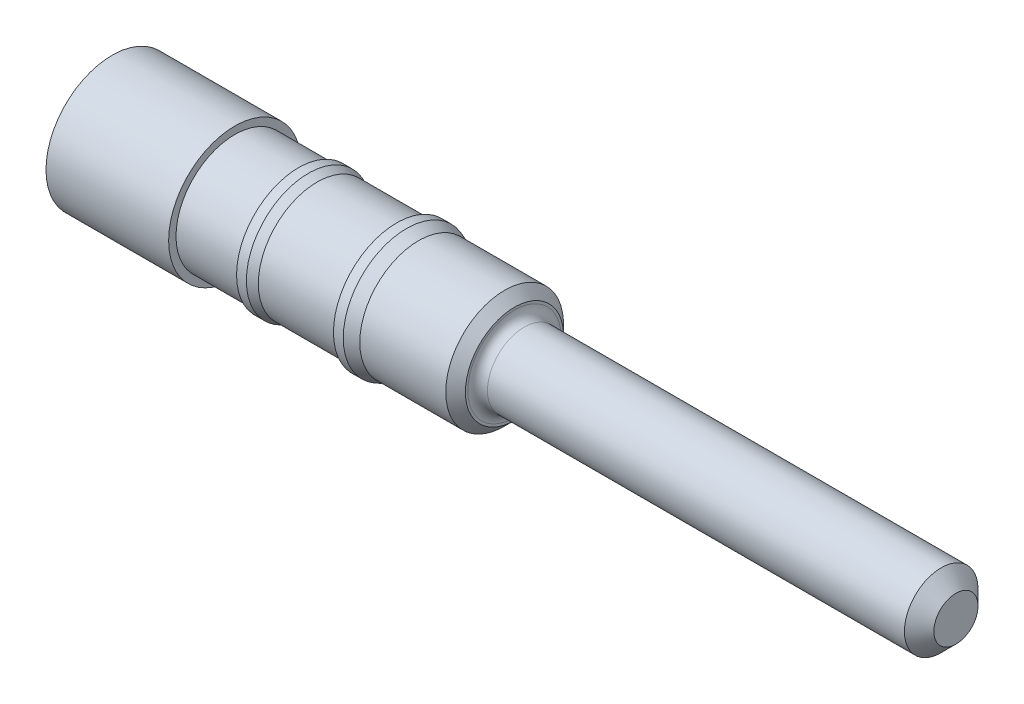
ISO-10303-21;
HEADER;
FILE_DESCRIPTION(('STEP AP214'),'2;1');
FILE_NAME('part.step','',(''),(''),'','','');
FILE_SCHEMA(('AUTOMOTIVE_DESIGN { 1 0 10303 214 1 1 1 1 }'));
ENDSEC;
DATA;
#1=APPLICATION_CONTEXT('core data for automotive mechanical design processes');
#2=APPLICATION_PROTOCOL_DEFINITION('international standard','automotive_design',2000,#1);
#3=PRODUCT_CONTEXT('',#1,'mechanical');
#4=PRODUCT('Part','Part','',(#3));
#5=PRODUCT_RELATED_PRODUCT_CATEGORY('part','',(#4));
#6=PRODUCT_DEFINITION_FORMATION('','',#4);
#7=PRODUCT_DEFINITION_CONTEXT('part definition',#1,'design');
#8=PRODUCT_DEFINITION('design','',#6,#7);
#9=PRODUCT_DEFINITION_SHAPE('','',#8);
#10=(LENGTH_UNIT() NAMED_UNIT(*) SI_UNIT(.MILLI.,.METRE.));
#11=(NAMED_UNIT(*) PLANE_ANGLE_UNIT() SI_UNIT($,.RADIAN.));
#12=(NAMED_UNIT(*) SI_UNIT($,.STERADIAN.) SOLID_ANGLE_UNIT());
#13=UNCERTAINTY_MEASURE_WITH_UNIT(LENGTH_MEASURE(1.E-05),#10,'distance_accuracy_value','');
#14=(GEOMETRIC_REPRESENTATION_CONTEXT(3) GLOBAL_UNCERTAINTY_ASSIGNED_CONTEXT((#13)) GLOBAL_UNIT_ASSIGNED_CONTEXT((#10,
#11,#12)) REPRESENTATION_CONTEXT('',''));
#15=CARTESIAN_POINT('',(0.,0.,0.));
#16=DIRECTION('',(0.,0.,1.));
#17=DIRECTION('',(1.,0.,0.));
#18=AXIS2_PLACEMENT_3D('',#15,#16,#17);
#19=CARTESIAN_POINT('',(0.,0.,0.));
#20=DIRECTION('',(1.,0.,0.));
#21=DIRECTION('',(0.,0.,-1.));
#22=AXIS2_PLACEMENT_3D('',#19,#20,#21);
#23=PLANE('',#22);
#24=CARTESIAN_POINT('',(0.,0.,0.));
#25=DIRECTION('',(-1.,0.,0.));
#26=DIRECTION('',(0.,0.,1.));
#27=AXIS2_PLACEMENT_3D('',#24,#25,#26);
#28=CIRCLE('',#27,0.3048);
#29=CARTESIAN_POINT('',(0.,0.,0.3048));
#30=VERTEX_POINT('',#29);
#31=EDGE_CURVE('E42',#30,#30,#28,.T.);
#32=ORIENTED_EDGE('',*,*,#31,.F.);
#33=EDGE_LOOP('',(#32));
#34=FACE_BOUND('',#33,.T.);
#35=CARTESIAN_POINT('',(0.,0.,0.));
#36=DIRECTION('',(-1.,0.,0.));
#37=DIRECTION('',(0.,0.,1.));
#38=AXIS2_PLACEMENT_3D('',#35,#36,#37);
#39=CIRCLE('',#38,0.3429);
#40=CARTESIAN_POINT('',(0.,0.,0.3429));
#41=VERTEX_POINT('',#40);
#42=EDGE_CURVE('E11',#41,#41,#39,.T.);
#43=ORIENTED_EDGE('',*,*,#42,.T.);
#44=EDGE_LOOP('',(#43));
#45=FACE_BOUND('',#44,.T.);
#46=ADVANCED_FACE('F16',(#34,#45),#23,.F.);
#47=CARTESIAN_POINT('',(0.,0.,0.));
#48=DIRECTION('',(-1.,0.,0.));
#49=DIRECTION('',(0.,0.,1.));
#50=AXIS2_PLACEMENT_3D('',#47,#48,#49);
#51=CYLINDRICAL_SURFACE('',#50,0.3429);
#52=ORIENTED_EDGE('',*,*,#42,.F.);
#53=EDGE_LOOP('',(#52));
#54=FACE_BOUND('',#53,.T.);
#55=CARTESIAN_POINT('',(0.635,0.,0.));
#56=DIRECTION('',(-1.,0.,0.));
#57=DIRECTION('',(0.,0.,1.));
#58=AXIS2_PLACEMENT_3D('',#55,#56,#57);
#59=CIRCLE('',#58,0.3429);
#60=CARTESIAN_POINT('',(0.635,0.,0.3429));
#61=VERTEX_POINT('',#60);
#62=EDGE_CURVE('E22',#61,#61,#59,.T.);
#63=ORIENTED_EDGE('',*,*,#62,.T.);
#64=EDGE_LOOP('',(#63));
#65=FACE_BOUND('',#64,.T.);
#66=ADVANCED_FACE('F89',(#54,#65),#51,.T.);
#67=CARTESIAN_POINT('',(0.635,0.3429,0.));
#68=DIRECTION('',(-1.,0.,0.));
#69=DIRECTION('',(0.,0.,1.));
#70=AXIS2_PLACEMENT_3D('',#67,#68,#69);
#71=PLANE('',#70);
#72=ORIENTED_EDGE('',*,*,#62,.F.);
#73=EDGE_LOOP('',(#72));
#74=FACE_BOUND('',#73,.T.);
#75=CARTESIAN_POINT('',(0.635,0.,0.));
#76=DIRECTION('',(-1.,0.,0.));
#77=DIRECTION('',(0.,0.,1.));
#78=AXIS2_PLACEMENT_3D('',#75,#76,#77);
#79=CIRCLE('',#78,0.3048);
#80=CARTESIAN_POINT('',(0.635,0.,0.3048));
#81=VERTEX_POINT('',#80);
#82=EDGE_CURVE('E84',#81,#81,#79,.T.);
#83=ORIENTED_EDGE('',*,*,#82,.T.);
#84=EDGE_LOOP('',(#83));
#85=FACE_BOUND('',#84,.T.);
#86=ADVANCED_FACE('F91',(#74,#85),#71,.F.);
#87=CARTESIAN_POINT('',(0.,0.,0.));
#88=DIRECTION('',(-1.,0.,0.));
#89=DIRECTION('',(0.,0.,1.));
#90=AXIS2_PLACEMENT_3D('',#87,#88,#89);
#91=CYLINDRICAL_SURFACE('',#90,0.3048);
#92=ORIENTED_EDGE('',*,*,#82,.F.);
#93=EDGE_LOOP('',(#92));
#94=FACE_BOUND('',#93,.T.);
#95=CARTESIAN_POINT('',(0.9652,0.,0.));
#96=DIRECTION('',(-1.,0.,0.));
#97=DIRECTION('',(0.,0.,1.));
#98=AXIS2_PLACEMENT_3D('',#95,#96,#97);
#99=CIRCLE('',#98,0.3048);
#100=CARTESIAN_POINT('',(0.9652,0.,0.3048));
#101=VERTEX_POINT('',#100);
#102=EDGE_CURVE('E81',#101,#101,#99,.T.);
#103=ORIENTED_EDGE('',*,*,#102,.T.);
#104=EDGE_LOOP('',(#103));
#105=FACE_BOUND('',#104,.T.);
#106=ADVANCED_FACE('F94',(#94,#105),#91,.T.);
#107=CARTESIAN_POINT('',(0.9652,0.3048,0.));
#108=DIRECTION('',(1.,0.,0.));
#109=DIRECTION('',(0.,0.,-1.));
#110=AXIS2_PLACEMENT_3D('',#107,#108,#109);
#111=PLANE('',#110);
#112=ORIENTED_EDGE('',*,*,#102,.F.);
#113=EDGE_LOOP('',(#112));
#114=FACE_BOUND('',#113,.T.);
#115=CARTESIAN_POINT('',(0.9652,0.,0.));
#116=DIRECTION('',(-1.,0.,0.));
#117=DIRECTION('',(0.,0.,1.));
#118=AXIS2_PLACEMENT_3D('',#115,#116,#117);
#119=CIRCLE('',#118,0.32131);
#120=CARTESIAN_POINT('',(0.9652,0.,0.32131));
#121=VERTEX_POINT('',#120);
#122=EDGE_CURVE('E78',#121,#121,#119,.T.);
#123=ORIENTED_EDGE('',*,*,#122,.T.);
#124=EDGE_LOOP('',(#123));
#125=FACE_BOUND('',#124,.T.);
#126=ADVANCED_FACE('F100',(#114,#125),#111,.F.);
#127=CARTESIAN_POINT('',(0.,0.,0.));
#128=DIRECTION('',(-1.,0.,0.));
#129=DIRECTION('',(0.,0.,1.));
#130=AXIS2_PLACEMENT_3D('',#127,#128,#129);
#131=CYLINDRICAL_SURFACE('',#130,0.32131);
#132=ORIENTED_EDGE('',*,*,#122,.F.);
#133=EDGE_LOOP('',(#132));
#134=FACE_BOUND('',#133,.T.);
#135=CARTESIAN_POINT('',(1.016,0.,0.));
#136=DIRECTION('',(-1.,0.,0.));
#137=DIRECTION('',(0.,0.,1.));
#138=AXIS2_PLACEMENT_3D('',#135,#136,#137);
#139=CIRCLE('',#138,0.32131);
#140=CARTESIAN_POINT('',(1.016,0.,0.32131));
#141=VERTEX_POINT('',#140);
#142=EDGE_CURVE('E75',#141,#141,#139,.T.);
#143=ORIENTED_EDGE('',*,*,#142,.T.);
#144=EDGE_LOOP('',(#143));
#145=FACE_BOUND('',#144,.T.);
#146=ADVANCED_FACE('F106',(#134,#145),#131,.T.);
#147=CARTESIAN_POINT('',(1.0613608521952,0.,0.));
#148=DIRECTION('',(-1.,0.,0.));
#149=DIRECTION('',(0.,0.,1.));
#150=AXIS2_PLACEMENT_3D('',#147,#148,#149);
#151=CONICAL_SURFACE('',#150,0.3048,0.349065850398866);
#152=ORIENTED_EDGE('',*,*,#142,.F.);
#153=EDGE_LOOP('',(#152));
#154=FACE_BOUND('',#153,.T.);
#155=CARTESIAN_POINT('',(1.0613608521952,0.,0.));
#156=DIRECTION('',(-1.,0.,0.));
#157=DIRECTION('',(0.,0.,1.));
#158=AXIS2_PLACEMENT_3D('',#155,#156,#157);
#159=CIRCLE('',#158,0.3048);
#160=CARTESIAN_POINT('',(1.0613608521952,0.,0.3048));
#161=VERTEX_POINT('',#160);
#162=EDGE_CURVE('E72',#161,#161,#159,.T.);
#163=ORIENTED_EDGE('',*,*,#162,.T.);
#164=EDGE_LOOP('',(#163));
#165=FACE_BOUND('',#164,.T.);
#166=ADVANCED_FACE('F112',(#154,#165),#151,.T.);
#167=CARTESIAN_POINT('',(0.,0.,0.));
#168=DIRECTION('',(-1.,0.,0.));
#169=DIRECTION('',(0.,0.,1.));
#170=AXIS2_PLACEMENT_3D('',#167,#168,#169);
#171=CYLINDRICAL_SURFACE('',#170,0.3048);
#172=ORIENTED_EDGE('',*,*,#162,.F.);
#173=EDGE_LOOP('',(#172));
#174=FACE_BOUND('',#173,.T.);
#175=CARTESIAN_POINT('',(1.4732,0.,0.));
#176=DIRECTION('',(-1.,0.,0.));
#177=DIRECTION('',(0.,0.,1.));
#178=AXIS2_PLACEMENT_3D('',#175,#176,#177);
#179=CIRCLE('',#178,0.3048);
#180=CARTESIAN_POINT('',(1.4732,0.,0.3048));
#181=VERTEX_POINT('',#180);
#182=EDGE_CURVE('E69',#181,#181,#179,.T.);
#183=ORIENTED_EDGE('',*,*,#182,.T.);
#184=EDGE_LOOP('',(#183));
#185=FACE_BOUND('',#184,.T.);
#186=ADVANCED_FACE('F118',(#174,#185),#171,.T.);
#187=CARTESIAN_POINT('',(1.4732,0.3048,0.));
#188=DIRECTION('',(1.,0.,0.));
#189=DIRECTION('',(0.,0.,-1.));
#190=AXIS2_PLACEMENT_3D('',#187,#188,#189);
#191=PLANE('',#190);
#192=ORIENTED_EDGE('',*,*,#182,.F.);
#193=EDGE_LOOP('',(#192));
#194=FACE_BOUND('',#193,.T.);
#195=CARTESIAN_POINT('',(1.4732,0.,0.));
#196=DIRECTION('',(-1.,0.,0.));
#197=DIRECTION('',(0.,0.,1.));
#198=AXIS2_PLACEMENT_3D('',#195,#196,#197);
#199=CIRCLE('',#198,0.32766);
#200=CARTESIAN_POINT('',(1.4732,0.,0.32766));
#201=VERTEX_POINT('',#200);
#202=EDGE_CURVE('E66',#201,#201,#199,.T.);
#203=ORIENTED_EDGE('',*,*,#202,.T.);
#204=EDGE_LOOP('',(#203));
#205=FACE_BOUND('',#204,.T.);
#206=ADVANCED_FACE('F124',(#194,#205),#191,.F.);
#207=CARTESIAN_POINT('',(0.,0.,0.));
#208=DIRECTION('',(-1.,0.,0.));
#209=DIRECTION('',(0.,0.,1.));
#210=AXIS2_PLACEMENT_3D('',#207,#208,#209);
#211=CYLINDRICAL_SURFACE('',#210,0.32766);
#212=ORIENTED_EDGE('',*,*,#202,.F.);
#213=EDGE_LOOP('',(#212));
#214=FACE_BOUND('',#213,.T.);
#215=CARTESIAN_POINT('',(1.524,0.,0.));
#216=DIRECTION('',(-1.,0.,0.));
#217=DIRECTION('',(0.,0.,1.));
#218=AXIS2_PLACEMENT_3D('',#215,#216,#217);
#219=CIRCLE('',#218,0.32766);
#220=CARTESIAN_POINT('',(1.524,0.,0.32766));
#221=VERTEX_POINT('',#220);
#222=EDGE_CURVE('E63',#221,#221,#219,.T.);
#223=ORIENTED_EDGE('',*,*,#222,.T.);
#224=EDGE_LOOP('',(#223));
#225=FACE_BOUND('',#224,.T.);
#226=ADVANCED_FACE('F130',(#214,#225),#211,.T.);
#227=CARTESIAN_POINT('',(1.58680733380873,0.,0.));
#228=DIRECTION('',(-1.,0.,0.));
#229=DIRECTION('',(0.,0.,1.));
#230=AXIS2_PLACEMENT_3D('',#227,#228,#229);
#231=CONICAL_SURFACE('',#230,0.3048,0.349065850398867);
#232=ORIENTED_EDGE('',*,*,#222,.F.);
#233=EDGE_LOOP('',(#232));
#234=FACE_BOUND('',#233,.T.);
#235=CARTESIAN_POINT('',(1.58680733380873,0.,0.));
#236=DIRECTION('',(-1.,0.,0.));
#237=DIRECTION('',(0.,0.,1.));
#238=AXIS2_PLACEMENT_3D('',#235,#236,#237);
#239=CIRCLE('',#238,0.3048);
#240=CARTESIAN_POINT('',(1.58680733380873,0.,0.3048));
#241=VERTEX_POINT('',#240);
#242=EDGE_CURVE('E60',#241,#241,#239,.T.);
#243=ORIENTED_EDGE('',*,*,#242,.T.);
#244=EDGE_LOOP('',(#243));
#245=FACE_BOUND('',#244,.T.);
#246=ADVANCED_FACE('F136',(#234,#245),#231,.T.);
#247=CARTESIAN_POINT('',(0.,0.,0.));
#248=DIRECTION('',(-1.,0.,0.));
#249=DIRECTION('',(0.,0.,1.));
#250=AXIS2_PLACEMENT_3D('',#247,#248,#249);
#251=CYLINDRICAL_SURFACE('',#250,0.3048);
#252=ORIENTED_EDGE('',*,*,#242,.F.);
#253=EDGE_LOOP('',(#252));
#254=FACE_BOUND('',#253,.T.);
#255=CARTESIAN_POINT('',(2.032,0.,0.));
#256=DIRECTION('',(-1.,0.,0.));
#257=DIRECTION('',(0.,0.,1.));
#258=AXIS2_PLACEMENT_3D('',#255,#256,#257);
#259=CIRCLE('',#258,0.3048);
#260=CARTESIAN_POINT('',(2.032,0.,0.3048));
#261=VERTEX_POINT('',#260);
#262=EDGE_CURVE('E57',#261,#261,#259,.T.);
#263=ORIENTED_EDGE('',*,*,#262,.T.);
#264=EDGE_LOOP('',(#263));
#265=FACE_BOUND('',#264,.T.);
#266=ADVANCED_FACE('F142',(#254,#265),#251,.T.);
#267=CARTESIAN_POINT('',(2.0828,0.,0.));
#268=DIRECTION('',(-1.,0.,0.));
#269=DIRECTION('',(0.,0.,1.));
#270=AXIS2_PLACEMENT_3D('',#267,#268,#269);
#271=CONICAL_SURFACE('',#270,0.254,0.785398163397445);
#272=ORIENTED_EDGE('',*,*,#262,.F.);
#273=EDGE_LOOP('',(#272));
#274=FACE_BOUND('',#273,.T.);
#275=CARTESIAN_POINT('',(2.0828,0.,0.));
#276=DIRECTION('',(-1.,0.,0.));
#277=DIRECTION('',(0.,0.,1.));
#278=AXIS2_PLACEMENT_3D('',#275,#276,#277);
#279=CIRCLE('',#278,0.254);
#280=CARTESIAN_POINT('',(2.0828,0.,0.254));
#281=VERTEX_POINT('',#280);
#282=EDGE_CURVE('E54',#281,#281,#279,.T.);
#283=ORIENTED_EDGE('',*,*,#282,.T.);
#284=EDGE_LOOP('',(#283));
#285=FACE_BOUND('',#284,.T.);
#286=ADVANCED_FACE('F148',(#274,#285),#271,.T.);
#287=CARTESIAN_POINT('',(2.0828,0.254,0.));
#288=DIRECTION('',(-1.,0.,0.));
#289=DIRECTION('',(0.,0.,1.));
#290=AXIS2_PLACEMENT_3D('',#287,#288,#289);
#291=PLANE('',#290);
#292=ORIENTED_EDGE('',*,*,#282,.F.);
#293=EDGE_LOOP('',(#292));
#294=FACE_BOUND('',#293,.T.);
#295=CARTESIAN_POINT('',(2.0828,0.,0.));
#296=DIRECTION('',(-1.,0.,0.));
#297=DIRECTION('',(0.,0.,1.));
#298=AXIS2_PLACEMENT_3D('',#295,#296,#297);
#299=CIRCLE('',#298,0.2413);
#300=CARTESIAN_POINT('',(2.0828,0.,0.2413));
#301=VERTEX_POINT('',#300);
#302=EDGE_CURVE('E51',#301,#301,#299,.T.);
#303=ORIENTED_EDGE('',*,*,#302,.T.);
#304=EDGE_LOOP('',(#303));
#305=FACE_BOUND('',#304,.T.);
#306=ADVANCED_FACE('F154',(#294,#305),#291,.F.);
#307=CARTESIAN_POINT('',(2.1336,0.,0.));
#308=DIRECTION('',(-1.,0.,0.));
#309=DIRECTION('',(0.,0.,1.));
#310=AXIS2_PLACEMENT_3D('',#307,#308,#309);
#311=TOROIDAL_SURFACE('',#310,0.2413,0.0508000000000001);
#312=ORIENTED_EDGE('',*,*,#302,.F.);
#313=EDGE_LOOP('',(#312));
#314=FACE_BOUND('',#313,.T.);
#315=CARTESIAN_POINT('',(2.1336,0.,0.));
#316=DIRECTION('',(-1.,0.,0.));
#317=DIRECTION('',(0.,0.,1.));
#318=AXIS2_PLACEMENT_3D('',#315,#316,#317);
#319=CIRCLE('',#318,0.1905);
#320=CARTESIAN_POINT('',(2.1336,0.,0.1905));
#321=VERTEX_POINT('',#320);
#322=EDGE_CURVE('E48',#321,#321,#319,.T.);
#323=ORIENTED_EDGE('',*,*,#322,.T.);
#324=EDGE_LOOP('',(#323));
#325=FACE_BOUND('',#324,.T.);
#326=ADVANCED_FACE('F160',(#314,#325),#311,.F.);
#327=CARTESIAN_POINT('',(0.,0.,0.));
#328=DIRECTION('',(-1.,0.,0.));
#329=DIRECTION('',(0.,0.,1.));
#330=AXIS2_PLACEMENT_3D('',#327,#328,#329);
#331=CYLINDRICAL_SURFACE('',#330,0.1905);
#332=ORIENTED_EDGE('',*,*,#322,.F.);
#333=EDGE_LOOP('',(#332));
#334=FACE_BOUND('',#333,.T.);
#335=CARTESIAN_POINT('',(4.2926,0.,0.));
#336=DIRECTION('',(-1.,0.,0.));
#337=DIRECTION('',(0.,0.,1.));
#338=AXIS2_PLACEMENT_3D('',#335,#336,#337);
#339=CIRCLE('',#338,0.1905);
#340=CARTESIAN_POINT('',(4.2926,0.,0.1905));
#341=VERTEX_POINT('',#340);
#342=EDGE_CURVE('E39',#341,#341,#339,.T.);
#343=ORIENTED_EDGE('',*,*,#342,.T.);
#344=EDGE_LOOP('',(#343));
#345=FACE_BOUND('',#344,.T.);
#346=ADVANCED_FACE('F166',(#334,#345),#331,.T.);
#347=CARTESIAN_POINT('',(4.3688,0.,0.));
#348=DIRECTION('',(-1.,0.,0.));
#349=DIRECTION('',(0.,0.,1.));
#350=AXIS2_PLACEMENT_3D('',#347,#348,#349);
#351=CONICAL_SURFACE('',#350,0.1143,0.785398163397452);
#352=ORIENTED_EDGE('',*,*,#342,.F.);
#353=EDGE_LOOP('',(#352));
#354=FACE_BOUND('',#353,.T.);
#355=CARTESIAN_POINT('',(4.3688,0.,0.));
#356=DIRECTION('',(-1.,0.,0.));
#357=DIRECTION('',(0.,0.,1.));
#358=AXIS2_PLACEMENT_3D('',#355,#356,#357);
#359=CIRCLE('',#358,0.1143);
#360=CARTESIAN_POINT('',(4.3688,0.,0.1143));
#361=VERTEX_POINT('',#360);
#362=EDGE_CURVE('E35',#361,#361,#359,.T.);
#363=ORIENTED_EDGE('',*,*,#362,.T.);
#364=EDGE_LOOP('',(#363));
#365=FACE_BOUND('',#364,.T.);
#366=ADVANCED_FACE('F172',(#354,#365),#351,.T.);
#367=CARTESIAN_POINT('',(4.3688,0.1143,0.));
#368=DIRECTION('',(-1.,0.,0.));
#369=DIRECTION('',(0.,0.,1.));
#370=AXIS2_PLACEMENT_3D('',#367,#368,#369);
#371=PLANE('',#370);
#372=ORIENTED_EDGE('',*,*,#362,.F.);
#373=EDGE_LOOP('',(#372));
#374=FACE_BOUND('',#373,.T.);
#375=ADVANCED_FACE('F29',(#374),#371,.F.);
#376=CARTESIAN_POINT('',(1.8415,0.,0.));
#377=DIRECTION('',(-1.,0.,0.));
#378=DIRECTION('',(0.,0.,1.));
#379=AXIS2_PLACEMENT_3D('',#376,#377,#378);
#380=CONICAL_SURFACE('',#379,0.26035,1.02974425867666);
#381=CARTESIAN_POINT('',(1.99793406216382,0.,0.));
#382=VERTEX_POINT('',#381);
#383=VERTEX_LOOP('',#382);
#384=FACE_BOUND('',#383,.T.);
#385=CARTESIAN_POINT('',(1.8415,0.,0.));
#386=DIRECTION('',(-1.,0.,0.));
#387=DIRECTION('',(0.,0.,1.));
#388=AXIS2_PLACEMENT_3D('',#385,#386,#387);
#389=CIRCLE('',#388,0.26035);
#390=CARTESIAN_POINT('',(1.8415,0.,0.26035));
#391=VERTEX_POINT('',#390);
#392=EDGE_CURVE('E33',#391,#391,#389,.T.);
#393=ORIENTED_EDGE('',*,*,#392,.T.);
#394=EDGE_LOOP('',(#393));
#395=FACE_BOUND('',#394,.T.);
#396=ADVANCED_FACE('F25',(#384,#395),#380,.F.);
#397=CARTESIAN_POINT('',(0.,0.,0.));
#398=DIRECTION('',(-1.,0.,0.));
#399=DIRECTION('',(0.,0.,1.));
#400=AXIS2_PLACEMENT_3D('',#397,#398,#399);
#401=CYLINDRICAL_SURFACE('',#400,0.26035);
#402=ORIENTED_EDGE('',*,*,#392,.F.);
#403=EDGE_LOOP('',(#402));
#404=FACE_BOUND('',#403,.T.);
#405=CARTESIAN_POINT('',(0.0444499999999997,0.,0.));
#406=DIRECTION('',(-1.,0.,0.));
#407=DIRECTION('',(0.,0.,1.));
#408=AXIS2_PLACEMENT_3D('',#405,#406,#407);
#409=CIRCLE('',#408,0.26035);
#410=CARTESIAN_POINT('',(0.0444499999999997,0.,0.26035));
#411=VERTEX_POINT('',#410);
#412=EDGE_CURVE('E36',#411,#411,#409,.T.);
#413=ORIENTED_EDGE('',*,*,#412,.T.);
#414=EDGE_LOOP('',(#413));
#415=FACE_BOUND('',#414,.T.);
#416=ADVANCED_FACE('F28',(#404,#415),#401,.F.);
#417=CARTESIAN_POINT('',(0.,0.,0.));
#418=DIRECTION('',(-1.,0.,0.));
#419=DIRECTION('',(0.,0.,1.));
#420=AXIS2_PLACEMENT_3D('',#417,#418,#419);
#421=CONICAL_SURFACE('',#420,0.3048,0.785398163397449);
#422=ORIENTED_EDGE('',*,*,#412,.F.);
#423=EDGE_LOOP('',(#422));
#424=FACE_BOUND('',#423,.T.);
#425=ORIENTED_EDGE('',*,*,#31,.T.);
#426=EDGE_LOOP('',(#425));
#427=FACE_BOUND('',#426,.T.);
#428=ADVANCED_FACE('F199',(#424,#427),#421,.F.);
#429=CLOSED_SHELL('',(#46,#66,#86,#106,#126,#146,#166,#186,#206,#226,#246,#266,#286,#306,#326,
#346,#366,#375,#396,#416,#428));
#430=MANIFOLD_SOLID_BREP('B1',#429);
#431=ADVANCED_BREP_SHAPE_REPRESENTATION('',(#18,#430),#14);
#432=SHAPE_DEFINITION_REPRESENTATION(#9,#431);
ENDSEC;
END-ISO-10303-21;
